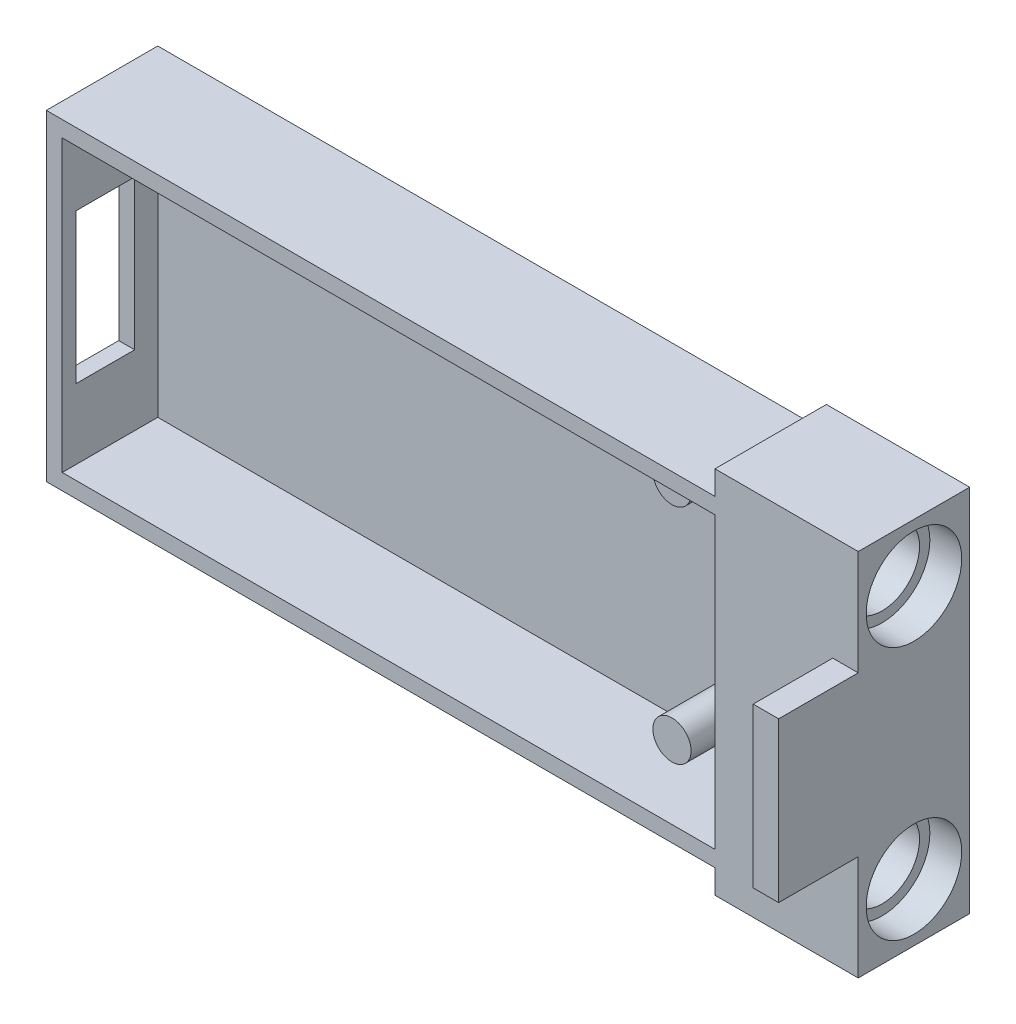
ISO-10303-21;
HEADER;
FILE_DESCRIPTION(('STEP AP214'),'2;1');
FILE_NAME('part.step','',(''),(''),'','','');
FILE_SCHEMA(('AUTOMOTIVE_DESIGN { 1 0 10303 214 1 1 1 1 }'));
ENDSEC;
DATA;
#1=APPLICATION_CONTEXT('core data for automotive mechanical design processes');
#2=APPLICATION_PROTOCOL_DEFINITION('international standard','automotive_design',2000,#1);
#3=PRODUCT_CONTEXT('',#1,'mechanical');
#4=PRODUCT('Part','Part','',(#3));
#5=PRODUCT_RELATED_PRODUCT_CATEGORY('part','',(#4));
#6=PRODUCT_DEFINITION_FORMATION('','',#4);
#7=PRODUCT_DEFINITION_CONTEXT('part definition',#1,'design');
#8=PRODUCT_DEFINITION('design','',#6,#7);
#9=PRODUCT_DEFINITION_SHAPE('','',#8);
#10=(LENGTH_UNIT() NAMED_UNIT(*) SI_UNIT(.MILLI.,.METRE.));
#11=(NAMED_UNIT(*) PLANE_ANGLE_UNIT() SI_UNIT($,.RADIAN.));
#12=(NAMED_UNIT(*) SI_UNIT($,.STERADIAN.) SOLID_ANGLE_UNIT());
#13=UNCERTAINTY_MEASURE_WITH_UNIT(LENGTH_MEASURE(1.E-05),#10,'distance_accuracy_value','');
#14=(GEOMETRIC_REPRESENTATION_CONTEXT(3) GLOBAL_UNCERTAINTY_ASSIGNED_CONTEXT((#13)) GLOBAL_UNIT_ASSIGNED_CONTEXT((#10,
#11,#12)) REPRESENTATION_CONTEXT('',''));
#15=CARTESIAN_POINT('',(0.,0.,0.));
#16=DIRECTION('',(0.,0.,1.));
#17=DIRECTION('',(1.,0.,0.));
#18=AXIS2_PLACEMENT_3D('',#15,#16,#17);
#19=CARTESIAN_POINT('',(0.,0.,7.));
#20=DIRECTION('',(0.,0.,-1.));
#21=DIRECTION('',(-1.,0.,0.));
#22=AXIS2_PLACEMENT_3D('',#19,#20,#21);
#23=PLANE('',#22);
#24=DIRECTION('',(-1.,0.,0.));
#25=VECTOR('',#24,1.);
#26=CARTESIAN_POINT('',(19.5,9.1,7.));
#27=LINE('',#26,#25);
#28=CARTESIAN_POINT('',(22.5,9.09999999999999,7.));
#29=VERTEX_POINT('',#28);
#30=CARTESIAN_POINT('',(-18.5,9.09999999999999,7.));
#31=VERTEX_POINT('',#30);
#32=EDGE_CURVE('E377',#29,#31,#27,.T.);
#33=ORIENTED_EDGE('',*,*,#32,.F.);
#34=DIRECTION('',(0.,-1.,0.));
#35=VECTOR('',#34,1.);
#36=CARTESIAN_POINT('',(22.5,11.6,7.));
#37=LINE('',#36,#35);
#38=CARTESIAN_POINT('',(22.5,-9.1,7.));
#39=VERTEX_POINT('',#38);
#40=EDGE_CURVE('E298',#29,#39,#37,.T.);
#41=ORIENTED_EDGE('',*,*,#40,.T.);
#42=DIRECTION('',(1.,0.,0.));
#43=VECTOR('',#42,1.);
#44=CARTESIAN_POINT('',(19.5,-9.1,7.));
#45=LINE('',#44,#43);
#46=CARTESIAN_POINT('',(-18.5,-9.1,7.));
#47=VERTEX_POINT('',#46);
#48=EDGE_CURVE('E382',#47,#39,#45,.T.);
#49=ORIENTED_EDGE('',*,*,#48,.F.);
#50=DIRECTION('',(0.,-1.,0.));
#51=VECTOR('',#50,1.);
#52=CARTESIAN_POINT('',(-18.5,9.09999999999999,7.));
#53=LINE('',#52,#51);
#54=EDGE_CURVE('E391',#31,#47,#53,.T.);
#55=ORIENTED_EDGE('',*,*,#54,.F.);
#56=EDGE_LOOP('',(#33,#41,#49,#55));
#57=FACE_BOUND('',#56,.T.);
#58=DIRECTION('',(1.,0.,0.));
#59=VECTOR('',#58,1.);
#60=CARTESIAN_POINT('',(31.5,-5.,7.));
#61=LINE('',#60,#59);
#62=CARTESIAN_POINT('',(29.9,-5.,7.));
#63=VERTEX_POINT('',#62);
#64=CARTESIAN_POINT('',(31.5,-5.,7.));
#65=VERTEX_POINT('',#64);
#66=EDGE_CURVE('E82',#63,#65,#61,.T.);
#67=ORIENTED_EDGE('',*,*,#66,.F.);
#68=DIRECTION('',(0.,-1.,0.));
#69=VECTOR('',#68,1.);
#70=CARTESIAN_POINT('',(29.9,5.,7.));
#71=LINE('',#70,#69);
#72=CARTESIAN_POINT('',(29.9,5.,7.));
#73=VERTEX_POINT('',#72);
#74=EDGE_CURVE('E884',#73,#63,#71,.T.);
#75=ORIENTED_EDGE('',*,*,#74,.F.);
#76=DIRECTION('',(-1.,0.,0.));
#77=VECTOR('',#76,1.);
#78=CARTESIAN_POINT('',(31.5,5.,7.));
#79=LINE('',#78,#77);
#80=CARTESIAN_POINT('',(31.5,5.,7.));
#81=VERTEX_POINT('',#80);
#82=EDGE_CURVE('E891',#81,#73,#79,.T.);
#83=ORIENTED_EDGE('',*,*,#82,.F.);
#84=DIRECTION('',(0.,-1.,0.));
#85=VECTOR('',#84,1.);
#86=CARTESIAN_POINT('',(31.5,11.6,7.));
#87=LINE('',#86,#85);
#88=CARTESIAN_POINT('',(31.5,11.6,7.));
#89=VERTEX_POINT('',#88);
#90=EDGE_CURVE('E250',#89,#81,#87,.T.);
#91=ORIENTED_EDGE('',*,*,#90,.F.);
#92=DIRECTION('',(-1.,0.,0.));
#93=VECTOR('',#92,1.);
#94=CARTESIAN_POINT('',(31.5,11.6,7.));
#95=LINE('',#94,#93);
#96=CARTESIAN_POINT('',(22.5,11.6,7.));
#97=VERTEX_POINT('',#96);
#98=EDGE_CURVE('E293',#89,#97,#95,.T.);
#99=ORIENTED_EDGE('',*,*,#98,.T.);
#100=CARTESIAN_POINT('',(22.5,10.1,7.));
#101=VERTEX_POINT('',#100);
#102=EDGE_CURVE('E294',#97,#101,#37,.T.);
#103=ORIENTED_EDGE('',*,*,#102,.T.);
#104=DIRECTION('',(-1.,0.,0.));
#105=VECTOR('',#104,1.);
#106=CARTESIAN_POINT('',(-19.5,10.1,7.));
#107=LINE('',#106,#105);
#108=CARTESIAN_POINT('',(-19.5,10.1,7.));
#109=VERTEX_POINT('',#108);
#110=EDGE_CURVE('E400',#101,#109,#107,.T.);
#111=ORIENTED_EDGE('',*,*,#110,.T.);
#112=DIRECTION('',(0.,-1.,0.));
#113=VECTOR('',#112,1.);
#114=CARTESIAN_POINT('',(-19.5,-10.1,7.));
#115=LINE('',#114,#113);
#116=CARTESIAN_POINT('',(-19.5,-10.1,7.));
#117=VERTEX_POINT('',#116);
#118=EDGE_CURVE('E402',#109,#117,#115,.T.);
#119=ORIENTED_EDGE('',*,*,#118,.T.);
#120=DIRECTION('',(1.,0.,0.));
#121=VECTOR('',#120,1.);
#122=CARTESIAN_POINT('',(-19.5,-10.1,7.));
#123=LINE('',#122,#121);
#124=CARTESIAN_POINT('',(22.5,-10.1,7.));
#125=VERTEX_POINT('',#124);
#126=EDGE_CURVE('E405',#117,#125,#123,.T.);
#127=ORIENTED_EDGE('',*,*,#126,.T.);
#128=CARTESIAN_POINT('',(22.5,-11.6,7.));
#129=VERTEX_POINT('',#128);
#130=EDGE_CURVE('E299',#125,#129,#37,.T.);
#131=ORIENTED_EDGE('',*,*,#130,.T.);
#132=DIRECTION('',(-1.,0.,0.));
#133=VECTOR('',#132,1.);
#134=CARTESIAN_POINT('',(31.5,-11.6,7.));
#135=LINE('',#134,#133);
#136=CARTESIAN_POINT('',(31.5,-11.6,7.));
#137=VERTEX_POINT('',#136);
#138=EDGE_CURVE('E315',#137,#129,#135,.T.);
#139=ORIENTED_EDGE('',*,*,#138,.F.);
#140=EDGE_CURVE('E87',#65,#137,#87,.T.);
#141=ORIENTED_EDGE('',*,*,#140,.F.);
#142=EDGE_LOOP('',(#67,#75,#83,#91,#99,#103,#111,#119,#127,#131,#139,#141));
#143=FACE_BOUND('',#142,.T.);
#144=ADVANCED_FACE('F65',(#57,#143),#23,.F.);
#145=CARTESIAN_POINT('',(22.5,-7.97,3.5));
#146=DIRECTION('',(1.,0.,0.));
#147=DIRECTION('',(0.,0.,-1.));
#148=AXIS2_PLACEMENT_3D('',#145,#146,#147);
#149=CYLINDRICAL_SURFACE('',#148,2.35);
#150=CARTESIAN_POINT('',(29.5,-7.97,3.5));
#151=DIRECTION('',(1.,0.,0.));
#152=DIRECTION('',(0.,0.,-1.));
#153=AXIS2_PLACEMENT_3D('',#150,#151,#152);
#154=CIRCLE('',#153,2.35);
#155=CARTESIAN_POINT('',(29.5,-7.97,1.15));
#156=VERTEX_POINT('',#155);
#157=EDGE_CURVE('E426',#156,#156,#154,.F.);
#158=ORIENTED_EDGE('',*,*,#157,.F.);
#159=EDGE_LOOP('',(#158));
#160=FACE_BOUND('',#159,.T.);
#161=CARTESIAN_POINT('',(23.5,-7.97,3.5));
#162=DIRECTION('',(-1.,0.,0.));
#163=DIRECTION('',(0.,0.,1.));
#164=AXIS2_PLACEMENT_3D('',#161,#162,#163);
#165=CIRCLE('',#164,2.35);
#166=CARTESIAN_POINT('',(23.5,-7.97,5.85));
#167=VERTEX_POINT('',#166);
#168=EDGE_CURVE('E69',#167,#167,#165,.F.);
#169=ORIENTED_EDGE('',*,*,#168,.F.);
#170=EDGE_LOOP('',(#169));
#171=FACE_BOUND('',#170,.T.);
#172=ADVANCED_FACE('F438',(#160,#171),#149,.F.);
#173=CARTESIAN_POINT('',(22.5,7.97,3.5));
#174=DIRECTION('',(1.,0.,0.));
#175=DIRECTION('',(0.,0.,-1.));
#176=AXIS2_PLACEMENT_3D('',#173,#174,#175);
#177=CYLINDRICAL_SURFACE('',#176,2.35);
#178=CARTESIAN_POINT('',(29.5,7.97,3.5));
#179=DIRECTION('',(1.,0.,0.));
#180=DIRECTION('',(0.,0.,-1.));
#181=AXIS2_PLACEMENT_3D('',#178,#179,#180);
#182=CIRCLE('',#181,2.35);
#183=CARTESIAN_POINT('',(29.5,7.97,1.15));
#184=VERTEX_POINT('',#183);
#185=EDGE_CURVE('E276',#184,#184,#182,.F.);
#186=ORIENTED_EDGE('',*,*,#185,.F.);
#187=EDGE_LOOP('',(#186));
#188=FACE_BOUND('',#187,.T.);
#189=CARTESIAN_POINT('',(23.5,7.97,3.5));
#190=DIRECTION('',(-1.,0.,0.));
#191=DIRECTION('',(0.,0.,1.));
#192=AXIS2_PLACEMENT_3D('',#189,#190,#191);
#193=CIRCLE('',#192,2.35);
#194=CARTESIAN_POINT('',(23.5,7.97,5.85));
#195=VERTEX_POINT('',#194);
#196=EDGE_CURVE('E263',#195,#195,#193,.F.);
#197=ORIENTED_EDGE('',*,*,#196,.F.);
#198=EDGE_LOOP('',(#197));
#199=FACE_BOUND('',#198,.T.);
#200=ADVANCED_FACE('F440',(#188,#199),#177,.F.);
#201=CARTESIAN_POINT('',(-19.5,10.1,7.));
#202=DIRECTION('',(0.,-1.,0.));
#203=DIRECTION('',(0.,0.,-1.));
#204=AXIS2_PLACEMENT_3D('',#201,#202,#203);
#205=PLANE('',#204);
#206=DIRECTION('',(-1.,0.,0.));
#207=VECTOR('',#206,1.);
#208=CARTESIAN_POINT('',(-19.5,10.1,0.));
#209=LINE('',#208,#207);
#210=CARTESIAN_POINT('',(22.5,10.1,0.));
#211=VERTEX_POINT('',#210);
#212=CARTESIAN_POINT('',(-19.5,10.1,0.));
#213=VERTEX_POINT('',#212);
#214=EDGE_CURVE('E398',#211,#213,#209,.T.);
#215=ORIENTED_EDGE('',*,*,#214,.T.);
#216=DIRECTION('',(0.,0.,-1.));
#217=VECTOR('',#216,1.);
#218=CARTESIAN_POINT('',(-19.5,10.1,7.));
#219=LINE('',#218,#217);
#220=EDGE_CURVE('E415',#109,#213,#219,.T.);
#221=ORIENTED_EDGE('',*,*,#220,.F.);
#222=ORIENTED_EDGE('',*,*,#110,.F.);
#223=DIRECTION('',(0.,0.,1.));
#224=VECTOR('',#223,1.);
#225=CARTESIAN_POINT('',(22.5,10.1,0.));
#226=LINE('',#225,#224);
#227=CARTESIAN_POINT('',(22.5,10.1,5.61260502697499));
#228=VERTEX_POINT('',#227);
#229=EDGE_CURVE('E318',#228,#101,#226,.T.);
#230=ORIENTED_EDGE('',*,*,#229,.F.);
#231=CARTESIAN_POINT('',(22.5,10.1,1.38739497302501));
#232=VERTEX_POINT('',#231);
#233=EDGE_CURVE('E337',#232,#228,#226,.T.);
#234=ORIENTED_EDGE('',*,*,#233,.F.);
#235=EDGE_CURVE('E333',#211,#232,#226,.T.);
#236=ORIENTED_EDGE('',*,*,#235,.F.);
#237=EDGE_LOOP('',(#215,#221,#222,#230,#234,#236));
#238=FACE_BOUND('',#237,.T.);
#239=ADVANCED_FACE('F67',(#238),#205,.F.);
#240=CARTESIAN_POINT('',(-19.5,-10.1,7.));
#241=DIRECTION('',(1.,0.,0.));
#242=DIRECTION('',(0.,0.,-1.));
#243=AXIS2_PLACEMENT_3D('',#240,#241,#242);
#244=PLANE('',#243);
#245=DIRECTION('',(0.,0.,1.));
#246=VECTOR('',#245,1.);
#247=CARTESIAN_POINT('',(-19.5,4.7,7.));
#248=LINE('',#247,#246);
#249=CARTESIAN_POINT('',(-19.5,4.7,2.45));
#250=VERTEX_POINT('',#249);
#251=CARTESIAN_POINT('',(-19.5,4.7,6.15));
#252=VERTEX_POINT('',#251);
#253=EDGE_CURVE('E365',#250,#252,#248,.T.);
#254=ORIENTED_EDGE('',*,*,#253,.T.);
#255=DIRECTION('',(0.,-1.,0.));
#256=VECTOR('',#255,1.);
#257=CARTESIAN_POINT('',(-19.5,-10.1,6.15));
#258=LINE('',#257,#256);
#259=CARTESIAN_POINT('',(-19.5,-4.7,6.15));
#260=VERTEX_POINT('',#259);
#261=EDGE_CURVE('E368',#252,#260,#258,.T.);
#262=ORIENTED_EDGE('',*,*,#261,.T.);
#263=DIRECTION('',(0.,0.,-1.));
#264=VECTOR('',#263,1.);
#265=CARTESIAN_POINT('',(-19.5,-4.7,7.));
#266=LINE('',#265,#264);
#267=CARTESIAN_POINT('',(-19.5,-4.7,2.45));
#268=VERTEX_POINT('',#267);
#269=EDGE_CURVE('E353',#260,#268,#266,.T.);
#270=ORIENTED_EDGE('',*,*,#269,.T.);
#271=DIRECTION('',(0.,1.,0.));
#272=VECTOR('',#271,1.);
#273=CARTESIAN_POINT('',(-19.5,-10.1,2.45));
#274=LINE('',#273,#272);
#275=EDGE_CURVE('E362',#268,#250,#274,.T.);
#276=ORIENTED_EDGE('',*,*,#275,.T.);
#277=EDGE_LOOP('',(#254,#262,#270,#276));
#278=FACE_BOUND('',#277,.T.);
#279=DIRECTION('',(0.,-1.,0.));
#280=VECTOR('',#279,1.);
#281=CARTESIAN_POINT('',(-19.5,-10.1,0.));
#282=LINE('',#281,#280);
#283=CARTESIAN_POINT('',(-19.5,-10.1,0.));
#284=VERTEX_POINT('',#283);
#285=EDGE_CURVE('E409',#213,#284,#282,.T.);
#286=ORIENTED_EDGE('',*,*,#285,.T.);
#287=DIRECTION('',(0.,0.,-1.));
#288=VECTOR('',#287,1.);
#289=CARTESIAN_POINT('',(-19.5,-10.1,7.));
#290=LINE('',#289,#288);
#291=EDGE_CURVE('E407',#117,#284,#290,.T.);
#292=ORIENTED_EDGE('',*,*,#291,.F.);
#293=ORIENTED_EDGE('',*,*,#118,.F.);
#294=ORIENTED_EDGE('',*,*,#220,.T.);
#295=EDGE_LOOP('',(#286,#292,#293,#294));
#296=FACE_BOUND('',#295,.T.);
#297=ADVANCED_FACE('F526',(#278,#296),#244,.F.);
#298=CARTESIAN_POINT('',(-19.5,-10.1,7.));
#299=DIRECTION('',(0.,1.,0.));
#300=DIRECTION('',(0.,0.,1.));
#301=AXIS2_PLACEMENT_3D('',#298,#299,#300);
#302=PLANE('',#301);
#303=DIRECTION('',(1.,0.,0.));
#304=VECTOR('',#303,1.);
#305=CARTESIAN_POINT('',(-19.5,-10.1,0.));
#306=LINE('',#305,#304);
#307=CARTESIAN_POINT('',(22.5,-10.1,0.));
#308=VERTEX_POINT('',#307);
#309=EDGE_CURVE('E403',#284,#308,#306,.T.);
#310=ORIENTED_EDGE('',*,*,#309,.T.);
#311=DIRECTION('',(0.,0.,-1.));
#312=VECTOR('',#311,1.);
#313=CARTESIAN_POINT('',(22.5,-10.1,0.));
#314=LINE('',#313,#312);
#315=CARTESIAN_POINT('',(22.5,-10.1,1.38739497302501));
#316=VERTEX_POINT('',#315);
#317=EDGE_CURVE('E327',#316,#308,#314,.T.);
#318=ORIENTED_EDGE('',*,*,#317,.F.);
#319=CARTESIAN_POINT('',(22.5,-10.1,5.61260502697499));
#320=VERTEX_POINT('',#319);
#321=EDGE_CURVE('E332',#320,#316,#314,.T.);
#322=ORIENTED_EDGE('',*,*,#321,.F.);
#323=EDGE_CURVE('E328',#125,#320,#314,.T.);
#324=ORIENTED_EDGE('',*,*,#323,.F.);
#325=ORIENTED_EDGE('',*,*,#126,.F.);
#326=ORIENTED_EDGE('',*,*,#291,.T.);
#327=EDGE_LOOP('',(#310,#318,#322,#324,#325,#326));
#328=FACE_BOUND('',#327,.T.);
#329=ADVANCED_FACE('F523',(#328),#302,.F.);
#330=CARTESIAN_POINT('',(0.,0.,0.));
#331=DIRECTION('',(0.,0.,-1.));
#332=DIRECTION('',(-1.,0.,0.));
#333=AXIS2_PLACEMENT_3D('',#330,#331,#332);
#334=PLANE('',#333);
#335=ORIENTED_EDGE('',*,*,#214,.F.);
#336=DIRECTION('',(0.,1.,0.));
#337=VECTOR('',#336,1.);
#338=CARTESIAN_POINT('',(22.5,11.6,0.));
#339=LINE('',#338,#337);
#340=CARTESIAN_POINT('',(22.5,11.6,0.));
#341=VERTEX_POINT('',#340);
#342=EDGE_CURVE('E301',#211,#341,#339,.T.);
#343=ORIENTED_EDGE('',*,*,#342,.T.);
#344=DIRECTION('',(-1.,0.,0.));
#345=VECTOR('',#344,1.);
#346=CARTESIAN_POINT('',(31.5,11.6,0.));
#347=LINE('',#346,#345);
#348=CARTESIAN_POINT('',(31.5,11.6,0.));
#349=VERTEX_POINT('',#348);
#350=EDGE_CURVE('E309',#349,#341,#347,.T.);
#351=ORIENTED_EDGE('',*,*,#350,.F.);
#352=DIRECTION('',(0.,1.,0.));
#353=VECTOR('',#352,1.);
#354=CARTESIAN_POINT('',(31.5,11.6,0.));
#355=LINE('',#354,#353);
#356=CARTESIAN_POINT('',(31.5,-11.6,0.));
#357=VERTEX_POINT('',#356);
#358=EDGE_CURVE('E289',#357,#349,#355,.T.);
#359=ORIENTED_EDGE('',*,*,#358,.F.);
#360=DIRECTION('',(-1.,0.,0.));
#361=VECTOR('',#360,1.);
#362=CARTESIAN_POINT('',(31.5,-11.6,0.));
#363=LINE('',#362,#361);
#364=CARTESIAN_POINT('',(22.5,-11.6,0.));
#365=VERTEX_POINT('',#364);
#366=EDGE_CURVE('E312',#357,#365,#363,.T.);
#367=ORIENTED_EDGE('',*,*,#366,.T.);
#368=EDGE_CURVE('E302',#365,#308,#339,.T.);
#369=ORIENTED_EDGE('',*,*,#368,.T.);
#370=ORIENTED_EDGE('',*,*,#309,.F.);
#371=ORIENTED_EDGE('',*,*,#285,.F.);
#372=EDGE_LOOP('',(#335,#343,#351,#359,#367,#369,#370,#371));
#373=FACE_BOUND('',#372,.T.);
#374=ADVANCED_FACE('F513',(#373),#334,.T.);
#375=CARTESIAN_POINT('',(19.5,-9.1,1.));
#376=DIRECTION('',(0.,-1.,0.));
#377=DIRECTION('',(1.,0.,0.));
#378=AXIS2_PLACEMENT_3D('',#375,#376,#377);
#379=PLANE('',#378);
#380=ORIENTED_EDGE('',*,*,#48,.T.);
#381=DIRECTION('',(0.,0.,1.));
#382=VECTOR('',#381,1.);
#383=CARTESIAN_POINT('',(22.5,-9.1,0.));
#384=LINE('',#383,#382);
#385=CARTESIAN_POINT('',(22.5,-9.1,6.27904659910553));
#386=VERTEX_POINT('',#385);
#387=EDGE_CURVE('E322',#386,#39,#384,.T.);
#388=ORIENTED_EDGE('',*,*,#387,.F.);
#389=CARTESIAN_POINT('',(22.5,-9.1,1.));
#390=VERTEX_POINT('',#389);
#391=EDGE_CURVE('E325',#390,#386,#384,.T.);
#392=ORIENTED_EDGE('',*,*,#391,.F.);
#393=DIRECTION('',(1.,0.,0.));
#394=VECTOR('',#393,1.);
#395=CARTESIAN_POINT('',(19.5,-9.1,1.));
#396=LINE('',#395,#394);
#397=CARTESIAN_POINT('',(-18.5,-9.1,1.));
#398=VERTEX_POINT('',#397);
#399=EDGE_CURVE('E385',#398,#390,#396,.T.);
#400=ORIENTED_EDGE('',*,*,#399,.F.);
#401=DIRECTION('',(0.,0.,1.));
#402=VECTOR('',#401,1.);
#403=CARTESIAN_POINT('',(-18.5,-9.1,1.));
#404=LINE('',#403,#402);
#405=EDGE_CURVE('E396',#398,#47,#404,.T.);
#406=ORIENTED_EDGE('',*,*,#405,.T.);
#407=EDGE_LOOP('',(#380,#388,#392,#400,#406));
#408=FACE_BOUND('',#407,.T.);
#409=ADVANCED_FACE('F509',(#408),#379,.F.);
#410=CARTESIAN_POINT('',(-18.5,9.09999999999999,1.));
#411=DIRECTION('',(-1.,0.,0.));
#412=DIRECTION('',(0.,0.,1.));
#413=AXIS2_PLACEMENT_3D('',#410,#411,#412);
#414=PLANE('',#413);
#415=DIRECTION('',(0.,0.,-1.));
#416=VECTOR('',#415,1.);
#417=CARTESIAN_POINT('',(-18.5,-4.7,6.15));
#418=LINE('',#417,#416);
#419=CARTESIAN_POINT('',(-18.5,-4.7,6.15));
#420=VERTEX_POINT('',#419);
#421=CARTESIAN_POINT('',(-18.5,-4.7,2.45));
#422=VERTEX_POINT('',#421);
#423=EDGE_CURVE('E341',#420,#422,#418,.T.);
#424=ORIENTED_EDGE('',*,*,#423,.F.);
#425=DIRECTION('',(0.,-1.,0.));
#426=VECTOR('',#425,1.);
#427=CARTESIAN_POINT('',(-18.5,-4.7,6.15));
#428=LINE('',#427,#426);
#429=CARTESIAN_POINT('',(-18.5,4.7,6.15));
#430=VERTEX_POINT('',#429);
#431=EDGE_CURVE('E331',#430,#420,#428,.T.);
#432=ORIENTED_EDGE('',*,*,#431,.F.);
#433=DIRECTION('',(0.,0.,1.));
#434=VECTOR('',#433,1.);
#435=CARTESIAN_POINT('',(-18.5,4.7,6.15));
#436=LINE('',#435,#434);
#437=CARTESIAN_POINT('',(-18.5,4.7,2.45));
#438=VERTEX_POINT('',#437);
#439=EDGE_CURVE('E347',#438,#430,#436,.T.);
#440=ORIENTED_EDGE('',*,*,#439,.F.);
#441=DIRECTION('',(0.,1.,0.));
#442=VECTOR('',#441,1.);
#443=CARTESIAN_POINT('',(-18.5,-4.7,2.45));
#444=LINE('',#443,#442);
#445=EDGE_CURVE('E344',#422,#438,#444,.T.);
#446=ORIENTED_EDGE('',*,*,#445,.F.);
#447=EDGE_LOOP('',(#424,#432,#440,#446));
#448=FACE_BOUND('',#447,.T.);
#449=ORIENTED_EDGE('',*,*,#54,.T.);
#450=ORIENTED_EDGE('',*,*,#405,.F.);
#451=DIRECTION('',(0.,-1.,0.));
#452=VECTOR('',#451,1.);
#453=CARTESIAN_POINT('',(-18.5,9.09999999999999,1.));
#454=LINE('',#453,#452);
#455=CARTESIAN_POINT('',(-18.5,9.09999999999999,1.));
#456=VERTEX_POINT('',#455);
#457=EDGE_CURVE('E381',#456,#398,#454,.T.);
#458=ORIENTED_EDGE('',*,*,#457,.F.);
#459=DIRECTION('',(0.,0.,1.));
#460=VECTOR('',#459,1.);
#461=CARTESIAN_POINT('',(-18.5,9.09999999999999,1.));
#462=LINE('',#461,#460);
#463=EDGE_CURVE('E388',#456,#31,#462,.T.);
#464=ORIENTED_EDGE('',*,*,#463,.T.);
#465=EDGE_LOOP('',(#449,#450,#458,#464));
#466=FACE_BOUND('',#465,.T.);
#467=ADVANCED_FACE('F512',(#448,#466),#414,.F.);
#468=CARTESIAN_POINT('',(19.5,9.1,1.));
#469=DIRECTION('',(0.,1.,0.));
#470=DIRECTION('',(-1.,0.,0.));
#471=AXIS2_PLACEMENT_3D('',#468,#469,#470);
#472=PLANE('',#471);
#473=ORIENTED_EDGE('',*,*,#32,.T.);
#474=ORIENTED_EDGE('',*,*,#463,.F.);
#475=DIRECTION('',(-1.,0.,0.));
#476=VECTOR('',#475,1.);
#477=CARTESIAN_POINT('',(19.5,9.1,1.));
#478=LINE('',#477,#476);
#479=CARTESIAN_POINT('',(22.5,9.1,1.));
#480=VERTEX_POINT('',#479);
#481=EDGE_CURVE('E378',#480,#456,#478,.T.);
#482=ORIENTED_EDGE('',*,*,#481,.F.);
#483=DIRECTION('',(0.,0.,1.));
#484=VECTOR('',#483,1.);
#485=CARTESIAN_POINT('',(22.5,9.09999999999999,0.));
#486=LINE('',#485,#484);
#487=CARTESIAN_POINT('',(22.5,9.09999999999999,6.27904659910553));
#488=VERTEX_POINT('',#487);
#489=EDGE_CURVE('E338',#480,#488,#486,.T.);
#490=ORIENTED_EDGE('',*,*,#489,.T.);
#491=EDGE_CURVE('E336',#488,#29,#486,.T.);
#492=ORIENTED_EDGE('',*,*,#491,.T.);
#493=EDGE_LOOP('',(#473,#474,#482,#490,#492));
#494=FACE_BOUND('',#493,.T.);
#495=ADVANCED_FACE('F507',(#494),#472,.F.);
#496=CARTESIAN_POINT('',(0.,0.,1.));
#497=DIRECTION('',(0.,0.,-1.));
#498=DIRECTION('',(-1.,0.,0.));
#499=AXIS2_PLACEMENT_3D('',#496,#497,#498);
#500=PLANE('',#499);
#501=CARTESIAN_POINT('',(17.3,6.99999999999999,1.));
#502=DIRECTION('',(0.,0.,-1.));
#503=DIRECTION('',(-1.,0.,0.));
#504=AXIS2_PLACEMENT_3D('',#501,#502,#503);
#505=CIRCLE('',#504,1.2);
#506=CARTESIAN_POINT('',(16.1,6.99999999999999,1.));
#507=VERTEX_POINT('',#506);
#508=EDGE_CURVE('E421',#507,#507,#505,.F.);
#509=ORIENTED_EDGE('',*,*,#508,.F.);
#510=EDGE_LOOP('',(#509));
#511=FACE_BOUND('',#510,.T.);
#512=CARTESIAN_POINT('',(17.3,-7.00000000000001,1.));
#513=DIRECTION('',(0.,0.,-1.));
#514=DIRECTION('',(-1.,0.,0.));
#515=AXIS2_PLACEMENT_3D('',#512,#513,#514);
#516=CIRCLE('',#515,1.2);
#517=CARTESIAN_POINT('',(16.1,-7.00000000000001,1.));
#518=VERTEX_POINT('',#517);
#519=EDGE_CURVE('E418',#518,#518,#516,.F.);
#520=ORIENTED_EDGE('',*,*,#519,.F.);
#521=EDGE_LOOP('',(#520));
#522=FACE_BOUND('',#521,.T.);
#523=ORIENTED_EDGE('',*,*,#399,.T.);
#524=DIRECTION('',(0.,-1.,0.));
#525=VECTOR('',#524,1.);
#526=CARTESIAN_POINT('',(22.5,0.,1.));
#527=LINE('',#526,#525);
#528=CARTESIAN_POINT('',(22.5,-6.3116876048223,1.));
#529=VERTEX_POINT('',#528);
#530=EDGE_CURVE('E324',#529,#390,#527,.T.);
#531=ORIENTED_EDGE('',*,*,#530,.F.);
#532=CARTESIAN_POINT('',(22.5,6.3116876048223,1.));
#533=VERTEX_POINT('',#532);
#534=EDGE_CURVE('E323',#533,#529,#527,.T.);
#535=ORIENTED_EDGE('',*,*,#534,.F.);
#536=EDGE_CURVE('E319',#480,#533,#527,.T.);
#537=ORIENTED_EDGE('',*,*,#536,.F.);
#538=ORIENTED_EDGE('',*,*,#481,.T.);
#539=ORIENTED_EDGE('',*,*,#457,.T.);
#540=EDGE_LOOP('',(#523,#531,#535,#537,#538,#539));
#541=FACE_BOUND('',#540,.T.);
#542=ADVANCED_FACE('F503',(#511,#522,#541),#500,.F.);
#543=CARTESIAN_POINT('',(17.3,-7.00000000000001,4.5));
#544=DIRECTION('',(0.,0.,-1.));
#545=DIRECTION('',(-1.,0.,0.));
#546=AXIS2_PLACEMENT_3D('',#543,#544,#545);
#547=CYLINDRICAL_SURFACE('',#546,1.2);
#548=CARTESIAN_POINT('',(17.3,-7.00000000000001,4.5));
#549=DIRECTION('',(0.,0.,1.));
#550=DIRECTION('',(1.,0.,0.));
#551=AXIS2_PLACEMENT_3D('',#548,#549,#550);
#552=CIRCLE('',#551,1.2);
#553=CARTESIAN_POINT('',(18.5,-7.00000000000001,4.5));
#554=VERTEX_POINT('',#553);
#555=EDGE_CURVE('E374',#554,#554,#552,.T.);
#556=ORIENTED_EDGE('',*,*,#555,.F.);
#557=EDGE_LOOP('',(#556));
#558=FACE_BOUND('',#557,.T.);
#559=ORIENTED_EDGE('',*,*,#519,.T.);
#560=EDGE_LOOP('',(#559));
#561=FACE_BOUND('',#560,.T.);
#562=ADVANCED_FACE('F499',(#558,#561),#547,.T.);
#563=CARTESIAN_POINT('',(17.3,-7.00000000000001,4.5));
#564=DIRECTION('',(0.,0.,1.));
#565=DIRECTION('',(1.,0.,0.));
#566=AXIS2_PLACEMENT_3D('',#563,#564,#565);
#567=PLANE('',#566);
#568=ORIENTED_EDGE('',*,*,#555,.T.);
#569=EDGE_LOOP('',(#568));
#570=FACE_BOUND('',#569,.T.);
#571=ADVANCED_FACE('F495',(#570),#567,.T.);
#572=CARTESIAN_POINT('',(17.3,6.99999999999999,4.5));
#573=DIRECTION('',(0.,0.,-1.));
#574=DIRECTION('',(-1.,0.,0.));
#575=AXIS2_PLACEMENT_3D('',#572,#573,#574);
#576=CYLINDRICAL_SURFACE('',#575,1.2);
#577=CARTESIAN_POINT('',(17.3,6.99999999999999,4.5));
#578=DIRECTION('',(0.,0.,1.));
#579=DIRECTION('',(1.,0.,0.));
#580=AXIS2_PLACEMENT_3D('',#577,#578,#579);
#581=CIRCLE('',#580,1.2);
#582=CARTESIAN_POINT('',(18.5,6.99999999999999,4.5));
#583=VERTEX_POINT('',#582);
#584=EDGE_CURVE('E371',#583,#583,#581,.T.);
#585=ORIENTED_EDGE('',*,*,#584,.F.);
#586=EDGE_LOOP('',(#585));
#587=FACE_BOUND('',#586,.T.);
#588=ORIENTED_EDGE('',*,*,#508,.T.);
#589=EDGE_LOOP('',(#588));
#590=FACE_BOUND('',#589,.T.);
#591=ADVANCED_FACE('F491',(#587,#590),#576,.T.);
#592=CARTESIAN_POINT('',(17.3,6.99999999999999,4.5));
#593=DIRECTION('',(0.,0.,1.));
#594=DIRECTION('',(1.,0.,0.));
#595=AXIS2_PLACEMENT_3D('',#592,#593,#594);
#596=PLANE('',#595);
#597=ORIENTED_EDGE('',*,*,#584,.T.);
#598=EDGE_LOOP('',(#597));
#599=FACE_BOUND('',#598,.T.);
#600=ADVANCED_FACE('F487',(#599),#596,.T.);
#601=CARTESIAN_POINT('',(-40.5,-4.7,6.15));
#602=DIRECTION('',(0.,0.,1.));
#603=DIRECTION('',(1.,0.,0.));
#604=AXIS2_PLACEMENT_3D('',#601,#602,#603);
#605=PLANE('',#604);
#606=DIRECTION('',(1.,0.,0.));
#607=VECTOR('',#606,1.);
#608=CARTESIAN_POINT('',(-40.5,4.7,6.15));
#609=LINE('',#608,#607);
#610=EDGE_CURVE('E351',#252,#430,#609,.T.);
#611=ORIENTED_EDGE('',*,*,#610,.T.);
#612=ORIENTED_EDGE('',*,*,#431,.T.);
#613=DIRECTION('',(1.,0.,0.));
#614=VECTOR('',#613,1.);
#615=CARTESIAN_POINT('',(-40.5,-4.7,6.15));
#616=LINE('',#615,#614);
#617=EDGE_CURVE('E350',#260,#420,#616,.T.);
#618=ORIENTED_EDGE('',*,*,#617,.F.);
#619=ORIENTED_EDGE('',*,*,#261,.F.);
#620=EDGE_LOOP('',(#611,#612,#618,#619));
#621=FACE_BOUND('',#620,.T.);
#622=ADVANCED_FACE('F476',(#621),#605,.F.);
#623=CARTESIAN_POINT('',(-40.5,4.7,6.15));
#624=DIRECTION('',(0.,1.,0.));
#625=DIRECTION('',(0.,0.,1.));
#626=AXIS2_PLACEMENT_3D('',#623,#624,#625);
#627=PLANE('',#626);
#628=DIRECTION('',(1.,0.,0.));
#629=VECTOR('',#628,1.);
#630=CARTESIAN_POINT('',(-40.5,4.7,2.45));
#631=LINE('',#630,#629);
#632=EDGE_CURVE('E354',#250,#438,#631,.T.);
#633=ORIENTED_EDGE('',*,*,#632,.T.);
#634=ORIENTED_EDGE('',*,*,#439,.T.);
#635=ORIENTED_EDGE('',*,*,#610,.F.);
#636=ORIENTED_EDGE('',*,*,#253,.F.);
#637=EDGE_LOOP('',(#633,#634,#635,#636));
#638=FACE_BOUND('',#637,.T.);
#639=ADVANCED_FACE('F472',(#638),#627,.F.);
#640=CARTESIAN_POINT('',(-40.5,-4.7,2.45));
#641=DIRECTION('',(0.,0.,-1.));
#642=DIRECTION('',(-1.,0.,0.));
#643=AXIS2_PLACEMENT_3D('',#640,#641,#642);
#644=PLANE('',#643);
#645=DIRECTION('',(1.,0.,0.));
#646=VECTOR('',#645,1.);
#647=CARTESIAN_POINT('',(-40.5,-4.7,2.45));
#648=LINE('',#647,#646);
#649=EDGE_CURVE('E356',#268,#422,#648,.T.);
#650=ORIENTED_EDGE('',*,*,#649,.T.);
#651=ORIENTED_EDGE('',*,*,#445,.T.);
#652=ORIENTED_EDGE('',*,*,#632,.F.);
#653=ORIENTED_EDGE('',*,*,#275,.F.);
#654=EDGE_LOOP('',(#650,#651,#652,#653));
#655=FACE_BOUND('',#654,.T.);
#656=ADVANCED_FACE('F475',(#655),#644,.F.);
#657=CARTESIAN_POINT('',(-40.5,-4.7,6.15));
#658=DIRECTION('',(0.,-1.,0.));
#659=DIRECTION('',(0.,0.,-1.));
#660=AXIS2_PLACEMENT_3D('',#657,#658,#659);
#661=PLANE('',#660);
#662=ORIENTED_EDGE('',*,*,#617,.T.);
#663=ORIENTED_EDGE('',*,*,#423,.T.);
#664=ORIENTED_EDGE('',*,*,#649,.F.);
#665=ORIENTED_EDGE('',*,*,#269,.F.);
#666=EDGE_LOOP('',(#662,#663,#664,#665));
#667=FACE_BOUND('',#666,.T.);
#668=ADVANCED_FACE('F480',(#667),#661,.F.);
#669=CARTESIAN_POINT('',(22.5,0.,0.));
#670=DIRECTION('',(1.,0.,0.));
#671=DIRECTION('',(0.,0.,-1.));
#672=AXIS2_PLACEMENT_3D('',#669,#670,#671);
#673=PLANE('',#672);
#674=ORIENTED_EDGE('',*,*,#235,.T.);
#675=CARTESIAN_POINT('',(22.5,7.97,3.5));
#676=DIRECTION('',(-1.,0.,0.));
#677=DIRECTION('',(0.,0.,1.));
#678=AXIS2_PLACEMENT_3D('',#675,#676,#677);
#679=CIRCLE('',#678,3.);
#680=EDGE_CURVE('E253',#228,#232,#679,.T.);
#681=ORIENTED_EDGE('',*,*,#680,.F.);
#682=ORIENTED_EDGE('',*,*,#229,.T.);
#683=ORIENTED_EDGE('',*,*,#102,.F.);
#684=DIRECTION('',(0.,0.,1.));
#685=VECTOR('',#684,1.);
#686=CARTESIAN_POINT('',(22.5,11.6,7.));
#687=LINE('',#686,#685);
#688=EDGE_CURVE('E305',#341,#97,#687,.T.);
#689=ORIENTED_EDGE('',*,*,#688,.F.);
#690=ORIENTED_EDGE('',*,*,#342,.F.);
#691=EDGE_LOOP('',(#674,#681,#682,#683,#689,#690));
#692=FACE_BOUND('',#691,.T.);
#693=ADVANCED_FACE('F463',(#692),#673,.F.);
#694=ORIENTED_EDGE('',*,*,#323,.T.);
#695=CARTESIAN_POINT('',(22.5,-7.97,3.5));
#696=DIRECTION('',(-1.,0.,0.));
#697=DIRECTION('',(0.,0.,1.));
#698=AXIS2_PLACEMENT_3D('',#695,#696,#697);
#699=CIRCLE('',#698,3.);
#700=EDGE_CURVE('E267',#316,#320,#699,.T.);
#701=ORIENTED_EDGE('',*,*,#700,.F.);
#702=ORIENTED_EDGE('',*,*,#317,.T.);
#703=ORIENTED_EDGE('',*,*,#368,.F.);
#704=DIRECTION('',(0.,0.,-1.));
#705=VECTOR('',#704,1.);
#706=CARTESIAN_POINT('',(22.5,-11.6,7.));
#707=LINE('',#706,#705);
#708=EDGE_CURVE('E297',#129,#365,#707,.T.);
#709=ORIENTED_EDGE('',*,*,#708,.F.);
#710=ORIENTED_EDGE('',*,*,#130,.F.);
#711=EDGE_LOOP('',(#694,#701,#702,#703,#709,#710));
#712=FACE_BOUND('',#711,.T.);
#713=ADVANCED_FACE('F464',(#712),#673,.F.);
#714=CARTESIAN_POINT('',(31.5,-11.6,7.));
#715=DIRECTION('',(0.,1.,0.));
#716=DIRECTION('',(0.,0.,1.));
#717=AXIS2_PLACEMENT_3D('',#714,#715,#716);
#718=PLANE('',#717);
#719=ORIENTED_EDGE('',*,*,#708,.T.);
#720=ORIENTED_EDGE('',*,*,#366,.F.);
#721=DIRECTION('',(0.,0.,-1.));
#722=VECTOR('',#721,1.);
#723=CARTESIAN_POINT('',(31.5,-11.6,7.));
#724=LINE('',#723,#722);
#725=EDGE_CURVE('E287',#137,#357,#724,.T.);
#726=ORIENTED_EDGE('',*,*,#725,.F.);
#727=ORIENTED_EDGE('',*,*,#138,.T.);
#728=EDGE_LOOP('',(#719,#720,#726,#727));
#729=FACE_BOUND('',#728,.T.);
#730=ADVANCED_FACE('F467',(#729),#718,.F.);
#731=CARTESIAN_POINT('',(31.5,11.6,7.));
#732=DIRECTION('',(0.,-1.,0.));
#733=DIRECTION('',(0.,0.,-1.));
#734=AXIS2_PLACEMENT_3D('',#731,#732,#733);
#735=PLANE('',#734);
#736=ORIENTED_EDGE('',*,*,#688,.T.);
#737=ORIENTED_EDGE('',*,*,#98,.F.);
#738=DIRECTION('',(0.,0.,1.));
#739=VECTOR('',#738,1.);
#740=CARTESIAN_POINT('',(31.5,11.6,7.));
#741=LINE('',#740,#739);
#742=EDGE_CURVE('E291',#349,#89,#741,.T.);
#743=ORIENTED_EDGE('',*,*,#742,.F.);
#744=ORIENTED_EDGE('',*,*,#350,.T.);
#745=EDGE_LOOP('',(#736,#737,#743,#744));
#746=FACE_BOUND('',#745,.T.);
#747=ADVANCED_FACE('F458',(#746),#735,.F.);
#748=CARTESIAN_POINT('',(31.5,0.,0.));
#749=DIRECTION('',(1.,0.,0.));
#750=DIRECTION('',(0.,0.,-1.));
#751=AXIS2_PLACEMENT_3D('',#748,#749,#750);
#752=PLANE('',#751);
#753=CARTESIAN_POINT('',(31.5,7.97,3.5));
#754=DIRECTION('',(1.,0.,0.));
#755=DIRECTION('',(0.,0.,-1.));
#756=AXIS2_PLACEMENT_3D('',#753,#754,#755);
#757=CIRCLE('',#756,3.);
#758=CARTESIAN_POINT('',(31.5,7.97,0.5));
#759=VERTEX_POINT('',#758);
#760=EDGE_CURVE('E277',#759,#759,#757,.T.);
#761=ORIENTED_EDGE('',*,*,#760,.F.);
#762=EDGE_LOOP('',(#761));
#763=FACE_BOUND('',#762,.T.);
#764=CARTESIAN_POINT('',(31.5,-7.97,3.5));
#765=DIRECTION('',(1.,0.,0.));
#766=DIRECTION('',(0.,0.,-1.));
#767=AXIS2_PLACEMENT_3D('',#764,#765,#766);
#768=CIRCLE('',#767,3.);
#769=CARTESIAN_POINT('',(31.5,-7.97,0.5));
#770=VERTEX_POINT('',#769);
#771=EDGE_CURVE('E283',#770,#770,#768,.T.);
#772=ORIENTED_EDGE('',*,*,#771,.F.);
#773=EDGE_LOOP('',(#772));
#774=FACE_BOUND('',#773,.T.);
#775=ORIENTED_EDGE('',*,*,#90,.T.);
#776=DIRECTION('',(0.,0.,-1.));
#777=VECTOR('',#776,1.);
#778=CARTESIAN_POINT('',(31.5,5.,12.));
#779=LINE('',#778,#777);
#780=CARTESIAN_POINT('',(31.5,5.,12.));
#781=VERTEX_POINT('',#780);
#782=EDGE_CURVE('E231',#781,#81,#779,.T.);
#783=ORIENTED_EDGE('',*,*,#782,.F.);
#784=DIRECTION('',(0.,1.,0.));
#785=VECTOR('',#784,1.);
#786=CARTESIAN_POINT('',(31.5,5.,12.));
#787=LINE('',#786,#785);
#788=CARTESIAN_POINT('',(31.5,-5.,12.));
#789=VERTEX_POINT('',#788);
#790=EDGE_CURVE('E237',#789,#781,#787,.T.);
#791=ORIENTED_EDGE('',*,*,#790,.F.);
#792=DIRECTION('',(0.,0.,-1.));
#793=VECTOR('',#792,1.);
#794=CARTESIAN_POINT('',(31.5,-5.,12.));
#795=LINE('',#794,#793);
#796=EDGE_CURVE('E882',#789,#65,#795,.T.);
#797=ORIENTED_EDGE('',*,*,#796,.T.);
#798=ORIENTED_EDGE('',*,*,#140,.T.);
#799=ORIENTED_EDGE('',*,*,#725,.T.);
#800=ORIENTED_EDGE('',*,*,#358,.T.);
#801=ORIENTED_EDGE('',*,*,#742,.T.);
#802=EDGE_LOOP('',(#775,#783,#791,#797,#798,#799,#800,#801));
#803=FACE_BOUND('',#802,.T.);
#804=ADVANCED_FACE('F248',(#763,#774,#803),#752,.T.);
#805=ORIENTED_EDGE('',*,*,#534,.T.);
#806=CARTESIAN_POINT('',(22.5,-7.97,3.5));
#807=DIRECTION('',(1.,0.,0.));
#808=DIRECTION('',(0.,0.,-1.));
#809=AXIS2_PLACEMENT_3D('',#806,#807,#808);
#810=CIRCLE('',#809,3.);
#811=EDGE_CURVE('E12',#529,#386,#810,.T.);
#812=ORIENTED_EDGE('',*,*,#811,.T.);
#813=ORIENTED_EDGE('',*,*,#387,.T.);
#814=ORIENTED_EDGE('',*,*,#40,.F.);
#815=ORIENTED_EDGE('',*,*,#491,.F.);
#816=CARTESIAN_POINT('',(22.5,7.97,3.5));
#817=DIRECTION('',(1.,0.,0.));
#818=DIRECTION('',(0.,0.,-1.));
#819=AXIS2_PLACEMENT_3D('',#816,#817,#818);
#820=CIRCLE('',#819,3.);
#821=EDGE_CURVE('E74',#488,#533,#820,.T.);
#822=ORIENTED_EDGE('',*,*,#821,.T.);
#823=EDGE_LOOP('',(#805,#812,#813,#814,#815,#822));
#824=FACE_BOUND('',#823,.T.);
#825=ADVANCED_FACE('F457',(#824),#673,.F.);
#826=CARTESIAN_POINT('',(22.5,-7.97,3.5));
#827=DIRECTION('',(1.,0.,0.));
#828=DIRECTION('',(0.,0.,-1.));
#829=AXIS2_PLACEMENT_3D('',#826,#827,#828);
#830=PLANE('',#829);
#831=ORIENTED_EDGE('',*,*,#321,.T.);
#832=EDGE_CURVE('E264',#529,#316,#699,.T.);
#833=ORIENTED_EDGE('',*,*,#832,.F.);
#834=ORIENTED_EDGE('',*,*,#530,.T.);
#835=ORIENTED_EDGE('',*,*,#391,.T.);
#836=EDGE_CURVE('E268',#320,#386,#699,.T.);
#837=ORIENTED_EDGE('',*,*,#836,.F.);
#838=EDGE_LOOP('',(#831,#833,#834,#835,#837));
#839=FACE_BOUND('',#838,.T.);
#840=ADVANCED_FACE('F454',(#839),#830,.T.);
#841=CARTESIAN_POINT('',(22.5,7.97,3.5));
#842=DIRECTION('',(1.,0.,0.));
#843=DIRECTION('',(0.,0.,-1.));
#844=AXIS2_PLACEMENT_3D('',#841,#842,#843);
#845=PLANE('',#844);
#846=ORIENTED_EDGE('',*,*,#233,.T.);
#847=EDGE_CURVE('E255',#488,#228,#679,.T.);
#848=ORIENTED_EDGE('',*,*,#847,.F.);
#849=ORIENTED_EDGE('',*,*,#489,.F.);
#850=ORIENTED_EDGE('',*,*,#536,.T.);
#851=EDGE_CURVE('E251',#232,#533,#679,.T.);
#852=ORIENTED_EDGE('',*,*,#851,.F.);
#853=EDGE_LOOP('',(#846,#848,#849,#850,#852));
#854=FACE_BOUND('',#853,.T.);
#855=ADVANCED_FACE('F584',(#854),#845,.T.);
#856=CARTESIAN_POINT('',(29.5,7.97,3.5));
#857=DIRECTION('',(1.,0.,0.));
#858=DIRECTION('',(0.,0.,-1.));
#859=AXIS2_PLACEMENT_3D('',#856,#857,#858);
#860=PLANE('',#859);
#861=CARTESIAN_POINT('',(29.5,7.97,3.5));
#862=DIRECTION('',(1.,0.,0.));
#863=DIRECTION('',(0.,0.,-1.));
#864=AXIS2_PLACEMENT_3D('',#861,#862,#863);
#865=CIRCLE('',#864,3.);
#866=CARTESIAN_POINT('',(29.5,7.97,0.5));
#867=VERTEX_POINT('',#866);
#868=EDGE_CURVE('E273',#867,#867,#865,.T.);
#869=ORIENTED_EDGE('',*,*,#868,.T.);
#870=EDGE_LOOP('',(#869));
#871=FACE_BOUND('',#870,.T.);
#872=ORIENTED_EDGE('',*,*,#185,.T.);
#873=EDGE_LOOP('',(#872));
#874=FACE_BOUND('',#873,.T.);
#875=ADVANCED_FACE('F609',(#871,#874),#860,.T.);
#876=CARTESIAN_POINT('',(29.5,7.97,3.5));
#877=DIRECTION('',(1.,0.,0.));
#878=DIRECTION('',(0.,0.,-1.));
#879=AXIS2_PLACEMENT_3D('',#876,#877,#878);
#880=CYLINDRICAL_SURFACE('',#879,3.);
#881=ORIENTED_EDGE('',*,*,#868,.F.);
#882=EDGE_LOOP('',(#881));
#883=FACE_BOUND('',#882,.T.);
#884=ORIENTED_EDGE('',*,*,#760,.T.);
#885=EDGE_LOOP('',(#884));
#886=FACE_BOUND('',#885,.T.);
#887=ADVANCED_FACE('F612',(#883,#886),#880,.F.);
#888=CARTESIAN_POINT('',(29.5,-7.97,3.5));
#889=DIRECTION('',(1.,0.,0.));
#890=DIRECTION('',(0.,0.,-1.));
#891=AXIS2_PLACEMENT_3D('',#888,#889,#890);
#892=PLANE('',#891);
#893=CARTESIAN_POINT('',(29.5,-7.97,3.5));
#894=DIRECTION('',(1.,0.,0.));
#895=DIRECTION('',(0.,0.,-1.));
#896=AXIS2_PLACEMENT_3D('',#893,#894,#895);
#897=CIRCLE('',#896,3.);
#898=CARTESIAN_POINT('',(29.5,-7.97,0.5));
#899=VERTEX_POINT('',#898);
#900=EDGE_CURVE('E280',#899,#899,#897,.T.);
#901=ORIENTED_EDGE('',*,*,#900,.T.);
#902=EDGE_LOOP('',(#901));
#903=FACE_BOUND('',#902,.T.);
#904=ORIENTED_EDGE('',*,*,#157,.T.);
#905=EDGE_LOOP('',(#904));
#906=FACE_BOUND('',#905,.T.);
#907=ADVANCED_FACE('F616',(#903,#906),#892,.T.);
#908=CARTESIAN_POINT('',(29.5,-7.97,3.5));
#909=DIRECTION('',(1.,0.,0.));
#910=DIRECTION('',(0.,0.,-1.));
#911=AXIS2_PLACEMENT_3D('',#908,#909,#910);
#912=CYLINDRICAL_SURFACE('',#911,3.);
#913=ORIENTED_EDGE('',*,*,#900,.F.);
#914=EDGE_LOOP('',(#913));
#915=FACE_BOUND('',#914,.T.);
#916=ORIENTED_EDGE('',*,*,#771,.T.);
#917=EDGE_LOOP('',(#916));
#918=FACE_BOUND('',#917,.T.);
#919=ADVANCED_FACE('F603',(#915,#918),#912,.F.);
#920=CARTESIAN_POINT('',(23.5,7.97,3.5));
#921=DIRECTION('',(-1.,0.,0.));
#922=DIRECTION('',(0.,0.,1.));
#923=AXIS2_PLACEMENT_3D('',#920,#921,#922);
#924=PLANE('',#923);
#925=CARTESIAN_POINT('',(23.5,7.97,3.5));
#926=DIRECTION('',(-1.,0.,0.));
#927=DIRECTION('',(0.,0.,1.));
#928=AXIS2_PLACEMENT_3D('',#925,#926,#927);
#929=CIRCLE('',#928,3.);
#930=CARTESIAN_POINT('',(23.5,7.97,6.5));
#931=VERTEX_POINT('',#930);
#932=EDGE_CURVE('E269',#931,#931,#929,.T.);
#933=ORIENTED_EDGE('',*,*,#932,.T.);
#934=EDGE_LOOP('',(#933));
#935=FACE_BOUND('',#934,.T.);
#936=ORIENTED_EDGE('',*,*,#196,.T.);
#937=EDGE_LOOP('',(#936));
#938=FACE_BOUND('',#937,.T.);
#939=ADVANCED_FACE('F594',(#935,#938),#924,.T.);
#940=CARTESIAN_POINT('',(23.5,7.97,3.5));
#941=DIRECTION('',(-1.,0.,0.));
#942=DIRECTION('',(0.,0.,1.));
#943=AXIS2_PLACEMENT_3D('',#940,#941,#942);
#944=CYLINDRICAL_SURFACE('',#943,3.);
#945=ORIENTED_EDGE('',*,*,#932,.F.);
#946=EDGE_LOOP('',(#945));
#947=FACE_BOUND('',#946,.T.);
#948=ORIENTED_EDGE('',*,*,#847,.T.);
#949=ORIENTED_EDGE('',*,*,#680,.T.);
#950=ORIENTED_EDGE('',*,*,#851,.T.);
#951=ORIENTED_EDGE('',*,*,#821,.F.);
#952=EDGE_LOOP('',(#948,#949,#950,#951));
#953=FACE_BOUND('',#952,.T.);
#954=ADVANCED_FACE('F587',(#947,#953),#944,.F.);
#955=CARTESIAN_POINT('',(23.5,-7.97,3.5));
#956=DIRECTION('',(-1.,0.,0.));
#957=DIRECTION('',(0.,0.,1.));
#958=AXIS2_PLACEMENT_3D('',#955,#956,#957);
#959=PLANE('',#958);
#960=CARTESIAN_POINT('',(23.5,-7.97,3.5));
#961=DIRECTION('',(-1.,0.,0.));
#962=DIRECTION('',(0.,0.,1.));
#963=AXIS2_PLACEMENT_3D('',#960,#961,#962);
#964=CIRCLE('',#963,3.);
#965=CARTESIAN_POINT('',(23.5,-7.97,6.5));
#966=VERTEX_POINT('',#965);
#967=EDGE_CURVE('E260',#966,#966,#964,.T.);
#968=ORIENTED_EDGE('',*,*,#967,.T.);
#969=EDGE_LOOP('',(#968));
#970=FACE_BOUND('',#969,.T.);
#971=ORIENTED_EDGE('',*,*,#168,.T.);
#972=EDGE_LOOP('',(#971));
#973=FACE_BOUND('',#972,.T.);
#974=ADVANCED_FACE('F436',(#970,#973),#959,.T.);
#975=CARTESIAN_POINT('',(23.5,-7.97,3.5));
#976=DIRECTION('',(-1.,0.,0.));
#977=DIRECTION('',(0.,0.,1.));
#978=AXIS2_PLACEMENT_3D('',#975,#976,#977);
#979=CYLINDRICAL_SURFACE('',#978,3.);
#980=ORIENTED_EDGE('',*,*,#967,.F.);
#981=EDGE_LOOP('',(#980));
#982=FACE_BOUND('',#981,.T.);
#983=ORIENTED_EDGE('',*,*,#832,.T.);
#984=ORIENTED_EDGE('',*,*,#700,.T.);
#985=ORIENTED_EDGE('',*,*,#836,.T.);
#986=ORIENTED_EDGE('',*,*,#811,.F.);
#987=EDGE_LOOP('',(#983,#984,#985,#986));
#988=FACE_BOUND('',#987,.T.);
#989=ADVANCED_FACE('F557',(#982,#988),#979,.F.);
#990=CARTESIAN_POINT('',(31.5,5.,12.));
#991=DIRECTION('',(0.,-1.,0.));
#992=DIRECTION('',(0.,0.,-1.));
#993=AXIS2_PLACEMENT_3D('',#990,#991,#992);
#994=PLANE('',#993);
#995=ORIENTED_EDGE('',*,*,#82,.T.);
#996=DIRECTION('',(0.,0.,-1.));
#997=VECTOR('',#996,1.);
#998=CARTESIAN_POINT('',(29.9,5.,12.));
#999=LINE('',#998,#997);
#1000=CARTESIAN_POINT('',(29.9,5.,12.));
#1001=VERTEX_POINT('',#1000);
#1002=EDGE_CURVE('E233',#1001,#73,#999,.T.);
#1003=ORIENTED_EDGE('',*,*,#1002,.F.);
#1004=DIRECTION('',(-1.,0.,0.));
#1005=VECTOR('',#1004,1.);
#1006=CARTESIAN_POINT('',(31.5,5.,12.));
#1007=LINE('',#1006,#1005);
#1008=EDGE_CURVE('E226',#781,#1001,#1007,.T.);
#1009=ORIENTED_EDGE('',*,*,#1008,.F.);
#1010=ORIENTED_EDGE('',*,*,#782,.T.);
#1011=EDGE_LOOP('',(#995,#1003,#1009,#1010));
#1012=FACE_BOUND('',#1011,.T.);
#1013=ADVANCED_FACE('F229',(#1012),#994,.F.);
#1014=CARTESIAN_POINT('',(29.9,5.,12.));
#1015=DIRECTION('',(1.,0.,0.));
#1016=DIRECTION('',(0.,0.,-1.));
#1017=AXIS2_PLACEMENT_3D('',#1014,#1015,#1016);
#1018=PLANE('',#1017);
#1019=ORIENTED_EDGE('',*,*,#74,.T.);
#1020=DIRECTION('',(0.,0.,-1.));
#1021=VECTOR('',#1020,1.);
#1022=CARTESIAN_POINT('',(29.9,-5.,12.));
#1023=LINE('',#1022,#1021);
#1024=CARTESIAN_POINT('',(29.9,-5.,12.));
#1025=VERTEX_POINT('',#1024);
#1026=EDGE_CURVE('E256',#1025,#63,#1023,.T.);
#1027=ORIENTED_EDGE('',*,*,#1026,.F.);
#1028=DIRECTION('',(0.,-1.,0.));
#1029=VECTOR('',#1028,1.);
#1030=CARTESIAN_POINT('',(29.9,5.,12.));
#1031=LINE('',#1030,#1029);
#1032=EDGE_CURVE('E236',#1001,#1025,#1031,.T.);
#1033=ORIENTED_EDGE('',*,*,#1032,.F.);
#1034=ORIENTED_EDGE('',*,*,#1002,.T.);
#1035=EDGE_LOOP('',(#1019,#1027,#1033,#1034));
#1036=FACE_BOUND('',#1035,.T.);
#1037=ADVANCED_FACE('F850',(#1036),#1018,.F.);
#1038=CARTESIAN_POINT('',(31.5,-5.,12.));
#1039=DIRECTION('',(0.,1.,0.));
#1040=DIRECTION('',(0.,0.,1.));
#1041=AXIS2_PLACEMENT_3D('',#1038,#1039,#1040);
#1042=PLANE('',#1041);
#1043=ORIENTED_EDGE('',*,*,#66,.T.);
#1044=ORIENTED_EDGE('',*,*,#796,.F.);
#1045=DIRECTION('',(1.,0.,0.));
#1046=VECTOR('',#1045,1.);
#1047=CARTESIAN_POINT('',(31.5,-5.,12.));
#1048=LINE('',#1047,#1046);
#1049=EDGE_CURVE('E242',#1025,#789,#1048,.T.);
#1050=ORIENTED_EDGE('',*,*,#1049,.F.);
#1051=ORIENTED_EDGE('',*,*,#1026,.T.);
#1052=EDGE_LOOP('',(#1043,#1044,#1050,#1051));
#1053=FACE_BOUND('',#1052,.T.);
#1054=ADVANCED_FACE('F856',(#1053),#1042,.F.);
#1055=CARTESIAN_POINT('',(0.,0.,12.));
#1056=DIRECTION('',(0.,0.,-1.));
#1057=DIRECTION('',(-1.,0.,0.));
#1058=AXIS2_PLACEMENT_3D('',#1055,#1056,#1057);
#1059=PLANE('',#1058);
#1060=ORIENTED_EDGE('',*,*,#790,.T.);
#1061=ORIENTED_EDGE('',*,*,#1008,.T.);
#1062=ORIENTED_EDGE('',*,*,#1032,.T.);
#1063=ORIENTED_EDGE('',*,*,#1049,.T.);
#1064=EDGE_LOOP('',(#1060,#1061,#1062,#1063));
#1065=FACE_BOUND('',#1064,.T.);
#1066=ADVANCED_FACE('F240',(#1065),#1059,.F.);
#1067=CLOSED_SHELL('',(#144,#172,#200,#239,#297,#329,#374,#409,#467,#495,#542,#562,#571,#591,
#600,#622,#639,#656,#668,#693,#713,#730,#747,#804,#825,#840,#855,#875,#887,#907,#919,#939,#954,
#974,#989,#1013,#1037,#1054,#1066));
#1068=MANIFOLD_SOLID_BREP('B2',#1067);
#1069=ADVANCED_BREP_SHAPE_REPRESENTATION('',(#18,#1068),#14);
#1070=SHAPE_DEFINITION_REPRESENTATION(#9,#1069);
ENDSEC;
END-ISO-10303-21;
